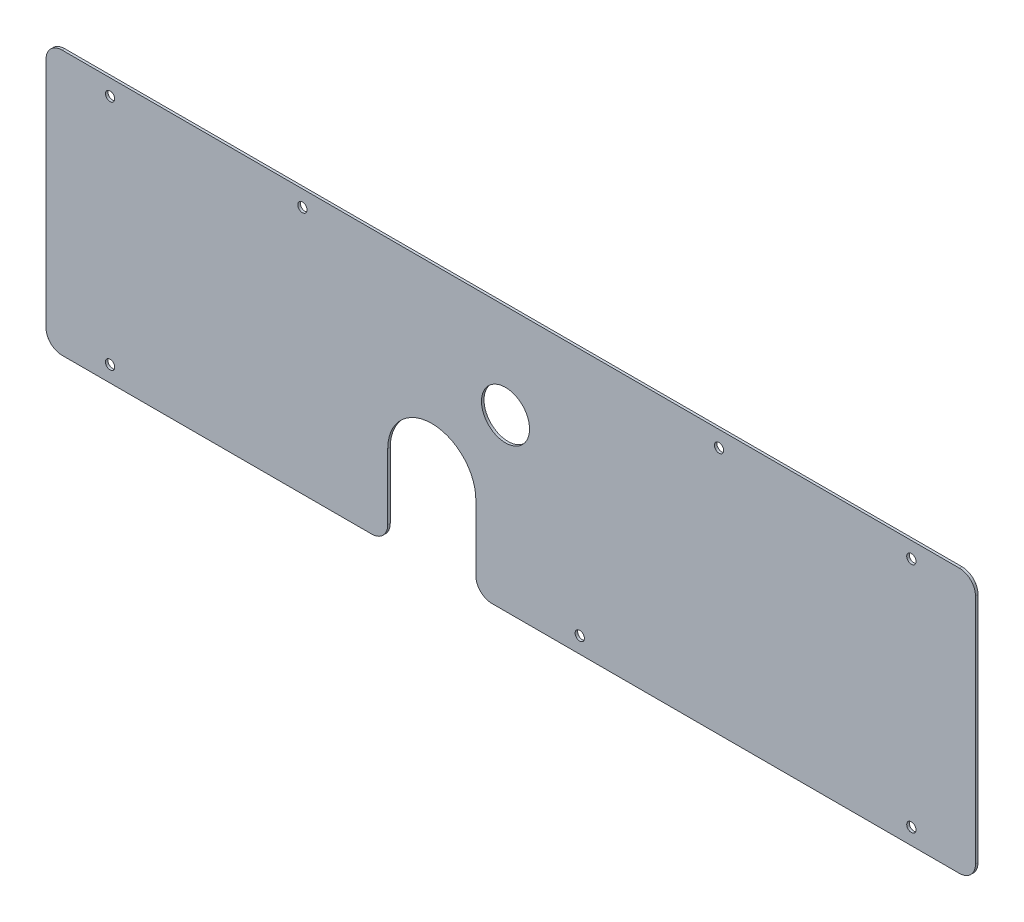
ISO-10303-21;
HEADER;
FILE_DESCRIPTION(('STEP AP214'),'2;1');
FILE_NAME('part.step','',(''),(''),'','','');
FILE_SCHEMA(('AUTOMOTIVE_DESIGN { 1 0 10303 214 1 1 1 1 }'));
ENDSEC;
DATA;
#1=APPLICATION_CONTEXT('core data for automotive mechanical design processes');
#2=APPLICATION_PROTOCOL_DEFINITION('international standard','automotive_design',2000,#1);
#3=PRODUCT_CONTEXT('',#1,'mechanical');
#4=PRODUCT('Part','Part','',(#3));
#5=PRODUCT_RELATED_PRODUCT_CATEGORY('part','',(#4));
#6=PRODUCT_DEFINITION_FORMATION('','',#4);
#7=PRODUCT_DEFINITION_CONTEXT('part definition',#1,'design');
#8=PRODUCT_DEFINITION('design','',#6,#7);
#9=PRODUCT_DEFINITION_SHAPE('','',#8);
#10=(LENGTH_UNIT() NAMED_UNIT(*) SI_UNIT(.MILLI.,.METRE.));
#11=(NAMED_UNIT(*) PLANE_ANGLE_UNIT() SI_UNIT($,.RADIAN.));
#12=(NAMED_UNIT(*) SI_UNIT($,.STERADIAN.) SOLID_ANGLE_UNIT());
#13=UNCERTAINTY_MEASURE_WITH_UNIT(LENGTH_MEASURE(1.E-05),#10,'distance_accuracy_value','');
#14=(GEOMETRIC_REPRESENTATION_CONTEXT(3) GLOBAL_UNCERTAINTY_ASSIGNED_CONTEXT((#13)) GLOBAL_UNIT_ASSIGNED_CONTEXT((#10,
#11,#12)) REPRESENTATION_CONTEXT('',''));
#15=CARTESIAN_POINT('',(0.,0.,0.));
#16=DIRECTION('',(0.,0.,1.));
#17=DIRECTION('',(1.,0.,0.));
#18=AXIS2_PLACEMENT_3D('',#15,#16,#17);
#19=CARTESIAN_POINT('',(-4.22130487143509,-10.7699955492583,1.5875));
#20=DIRECTION('',(0.,0.,1.));
#21=DIRECTION('',(1.,0.,0.));
#22=AXIS2_PLACEMENT_3D('',#19,#20,#21);
#23=PLANE('',#22);
#24=CARTESIAN_POINT('',(-204.957511761531,93.1698044507419,1.5875));
#25=DIRECTION('',(0.,0.,1.));
#26=DIRECTION('',(1.,0.,0.));
#27=AXIS2_PLACEMENT_3D('',#24,#25,#26);
#28=CIRCLE('',#27,2.89999999999999);
#29=CARTESIAN_POINT('',(-202.057511761531,93.1698044507419,1.5875));
#30=VERTEX_POINT('',#29);
#31=EDGE_CURVE('E326',#30,#30,#28,.T.);
#32=ORIENTED_EDGE('',*,*,#31,.F.);
#33=EDGE_LOOP('',(#32));
#34=FACE_BOUND('',#33,.T.);
#35=CARTESIAN_POINT('',(-204.957511761531,-51.8097955492581,1.5875));
#36=DIRECTION('',(0.,0.,1.));
#37=DIRECTION('',(1.,0.,0.));
#38=AXIS2_PLACEMENT_3D('',#35,#36,#37);
#39=CIRCLE('',#38,2.89999999999999);
#40=CARTESIAN_POINT('',(-202.057511761531,-51.8097955492581,1.5875));
#41=VERTEX_POINT('',#40);
#42=EDGE_CURVE('E320',#41,#41,#39,.T.);
#43=ORIENTED_EDGE('',*,*,#42,.F.);
#44=EDGE_LOOP('',(#43));
#45=FACE_BOUND('',#44,.T.);
#46=CARTESIAN_POINT('',(88.1217757354174,-51.8097955492581,1.5875));
#47=DIRECTION('',(0.,0.,1.));
#48=DIRECTION('',(1.,0.,0.));
#49=AXIS2_PLACEMENT_3D('',#46,#47,#48);
#50=CIRCLE('',#49,2.89999999999999);
#51=CARTESIAN_POINT('',(91.0217757354174,-51.8097955492581,1.5875));
#52=VERTEX_POINT('',#51);
#53=EDGE_CURVE('E314',#52,#52,#50,.T.);
#54=ORIENTED_EDGE('',*,*,#53,.F.);
#55=EDGE_LOOP('',(#54));
#56=FACE_BOUND('',#55,.T.);
#57=CARTESIAN_POINT('',(295.042488238469,-51.8097955492581,1.5875));
#58=DIRECTION('',(0.,0.,1.));
#59=DIRECTION('',(1.,0.,0.));
#60=AXIS2_PLACEMENT_3D('',#57,#58,#59);
#61=CIRCLE('',#60,2.90000000000001);
#62=CARTESIAN_POINT('',(297.942488238469,-51.8097955492581,1.5875));
#63=VERTEX_POINT('',#62);
#64=EDGE_CURVE('E308',#63,#63,#61,.T.);
#65=ORIENTED_EDGE('',*,*,#64,.F.);
#66=EDGE_LOOP('',(#65));
#67=FACE_BOUND('',#66,.T.);
#68=CARTESIAN_POINT('',(-84.9575117615307,93.1698044507419,1.5875));
#69=DIRECTION('',(0.,0.,1.));
#70=DIRECTION('',(1.,0.,0.));
#71=AXIS2_PLACEMENT_3D('',#68,#69,#70);
#72=CIRCLE('',#71,2.89999999999999);
#73=CARTESIAN_POINT('',(-82.0575117615307,93.1698044507419,1.5875));
#74=VERTEX_POINT('',#73);
#75=EDGE_CURVE('E302',#74,#74,#72,.T.);
#76=ORIENTED_EDGE('',*,*,#75,.F.);
#77=EDGE_LOOP('',(#76));
#78=FACE_BOUND('',#77,.T.);
#79=CARTESIAN_POINT('',(175.042488238469,93.1698044507419,1.5875));
#80=DIRECTION('',(0.,0.,1.));
#81=DIRECTION('',(1.,0.,0.));
#82=AXIS2_PLACEMENT_3D('',#79,#80,#81);
#83=CIRCLE('',#82,2.89999999999999);
#84=CARTESIAN_POINT('',(177.942488238469,93.1698044507419,1.5875));
#85=VERTEX_POINT('',#84);
#86=EDGE_CURVE('E296',#85,#85,#83,.T.);
#87=ORIENTED_EDGE('',*,*,#86,.F.);
#88=EDGE_LOOP('',(#87));
#89=FACE_BOUND('',#88,.T.);
#90=CARTESIAN_POINT('',(295.042488238469,93.1698044507419,1.5875));
#91=DIRECTION('',(0.,0.,1.));
#92=DIRECTION('',(1.,0.,0.));
#93=AXIS2_PLACEMENT_3D('',#90,#91,#92);
#94=CIRCLE('',#93,2.90000000000001);
#95=CARTESIAN_POINT('',(297.942488238469,93.1698044507419,1.5875));
#96=VERTEX_POINT('',#95);
#97=EDGE_CURVE('E290',#96,#96,#94,.T.);
#98=ORIENTED_EDGE('',*,*,#97,.F.);
#99=EDGE_LOOP('',(#98));
#100=FACE_BOUND('',#99,.T.);
#101=DIRECTION('',(0.,-1.,0.));
#102=VECTOR('',#101,1.);
#103=CARTESIAN_POINT('',(23.2786951285649,-10.7699955492583,1.5875));
#104=LINE('',#103,#102);
#105=CARTESIAN_POINT('',(23.2786951285649,-10.7699955492583,1.5875));
#106=VERTEX_POINT('',#105);
#107=CARTESIAN_POINT('',(23.2786951285649,-51.8097955492581,1.5875));
#108=VERTEX_POINT('',#107);
#109=EDGE_CURVE('E165',#106,#108,#104,.T.);
#110=ORIENTED_EDGE('',*,*,#109,.T.);
#111=CARTESIAN_POINT('',(33.2786951285649,-51.8097955492581,1.5875));
#112=DIRECTION('',(0.,0.,1.));
#113=DIRECTION('',(1.,0.,0.));
#114=AXIS2_PLACEMENT_3D('',#111,#112,#113);
#115=CIRCLE('',#114,10.);
#116=CARTESIAN_POINT('',(33.2786951285649,-61.8097955492581,1.5875));
#117=VERTEX_POINT('',#116);
#118=EDGE_CURVE('E226',#108,#117,#115,.T.);
#119=ORIENTED_EDGE('',*,*,#118,.T.);
#120=DIRECTION('',(1.,0.,0.));
#121=VECTOR('',#120,1.);
#122=CARTESIAN_POINT('',(23.2786951285649,-61.8097955492581,1.5875));
#123=LINE('',#122,#121);
#124=CARTESIAN_POINT('',(325.042488238469,-61.809795549258,1.5875));
#125=VERTEX_POINT('',#124);
#126=EDGE_CURVE('E167',#117,#125,#123,.T.);
#127=ORIENTED_EDGE('',*,*,#126,.T.);
#128=CARTESIAN_POINT('',(325.042488238469,-51.809795549258,1.5875));
#129=DIRECTION('',(0.,0.,1.));
#130=DIRECTION('',(1.,0.,0.));
#131=AXIS2_PLACEMENT_3D('',#128,#129,#130);
#132=CIRCLE('',#131,10.);
#133=CARTESIAN_POINT('',(335.042488238469,-51.809795549258,1.5875));
#134=VERTEX_POINT('',#133);
#135=EDGE_CURVE('E218',#125,#134,#132,.T.);
#136=ORIENTED_EDGE('',*,*,#135,.T.);
#137=DIRECTION('',(0.,1.,0.));
#138=VECTOR('',#137,1.);
#139=CARTESIAN_POINT('',(335.042488238469,103.169804450742,1.5875));
#140=LINE('',#139,#138);
#141=CARTESIAN_POINT('',(335.042488238469,93.1698044507419,1.5875));
#142=VERTEX_POINT('',#141);
#143=EDGE_CURVE('E173',#134,#142,#140,.T.);
#144=ORIENTED_EDGE('',*,*,#143,.T.);
#145=CARTESIAN_POINT('',(325.042488238469,93.1698044507419,1.5875));
#146=DIRECTION('',(0.,0.,1.));
#147=DIRECTION('',(1.,0.,0.));
#148=AXIS2_PLACEMENT_3D('',#145,#146,#147);
#149=CIRCLE('',#148,10.);
#150=CARTESIAN_POINT('',(325.042488238469,103.169804450742,1.5875));
#151=VERTEX_POINT('',#150);
#152=EDGE_CURVE('E59',#142,#151,#149,.T.);
#153=ORIENTED_EDGE('',*,*,#152,.T.);
#154=DIRECTION('',(-1.,0.,0.));
#155=VECTOR('',#154,1.);
#156=CARTESIAN_POINT('',(-244.957511761531,103.169804450742,1.5875));
#157=LINE('',#156,#155);
#158=CARTESIAN_POINT('',(-234.957511761531,103.169804450742,1.5875));
#159=VERTEX_POINT('',#158);
#160=EDGE_CURVE('E175',#151,#159,#157,.T.);
#161=ORIENTED_EDGE('',*,*,#160,.T.);
#162=CARTESIAN_POINT('',(-234.957511761531,93.1698044507419,1.5875));
#163=DIRECTION('',(0.,0.,1.));
#164=DIRECTION('',(1.,0.,0.));
#165=AXIS2_PLACEMENT_3D('',#162,#163,#164);
#166=CIRCLE('',#165,10.);
#167=CARTESIAN_POINT('',(-244.957511761531,93.1698044507419,1.5875));
#168=VERTEX_POINT('',#167);
#169=EDGE_CURVE('E223',#159,#168,#166,.T.);
#170=ORIENTED_EDGE('',*,*,#169,.T.);
#171=DIRECTION('',(0.,-1.,0.));
#172=VECTOR('',#171,1.);
#173=CARTESIAN_POINT('',(-244.957511761531,103.169804450742,1.5875));
#174=LINE('',#173,#172);
#175=CARTESIAN_POINT('',(-244.957511761531,-51.8097955492581,1.5875));
#176=VERTEX_POINT('',#175);
#177=EDGE_CURVE('E198',#168,#176,#174,.T.);
#178=ORIENTED_EDGE('',*,*,#177,.T.);
#179=CARTESIAN_POINT('',(-234.957511761531,-51.8097955492581,1.5875));
#180=DIRECTION('',(0.,0.,1.));
#181=DIRECTION('',(1.,0.,0.));
#182=AXIS2_PLACEMENT_3D('',#179,#180,#181);
#183=CIRCLE('',#182,10.);
#184=CARTESIAN_POINT('',(-234.957511761531,-61.8097955492581,1.5875));
#185=VERTEX_POINT('',#184);
#186=EDGE_CURVE('E221',#176,#185,#183,.T.);
#187=ORIENTED_EDGE('',*,*,#186,.T.);
#188=DIRECTION('',(1.,0.,0.));
#189=VECTOR('',#188,1.);
#190=CARTESIAN_POINT('',(-244.957511761531,-61.8097955492581,1.5875));
#191=LINE('',#190,#189);
#192=CARTESIAN_POINT('',(-41.7213048714351,-61.8097955492581,1.5875));
#193=VERTEX_POINT('',#192);
#194=EDGE_CURVE('E150',#185,#193,#191,.T.);
#195=ORIENTED_EDGE('',*,*,#194,.T.);
#196=CARTESIAN_POINT('',(-41.7213048714351,-51.8097955492581,1.5875));
#197=DIRECTION('',(0.,0.,1.));
#198=DIRECTION('',(1.,0.,0.));
#199=AXIS2_PLACEMENT_3D('',#196,#197,#198);
#200=CIRCLE('',#199,10.);
#201=CARTESIAN_POINT('',(-31.7213048714351,-51.8097955492581,1.5875));
#202=VERTEX_POINT('',#201);
#203=EDGE_CURVE('E146',#193,#202,#200,.T.);
#204=ORIENTED_EDGE('',*,*,#203,.T.);
#205=DIRECTION('',(0.,1.,0.));
#206=VECTOR('',#205,1.);
#207=CARTESIAN_POINT('',(-31.7213048714351,-10.7699955492583,1.5875));
#208=LINE('',#207,#206);
#209=CARTESIAN_POINT('',(-31.7213048714351,-10.7699955492583,1.5875));
#210=VERTEX_POINT('',#209);
#211=EDGE_CURVE('E137',#202,#210,#208,.T.);
#212=ORIENTED_EDGE('',*,*,#211,.T.);
#213=CARTESIAN_POINT('',(-4.22130487143509,-10.7699955492583,1.5875));
#214=DIRECTION('',(0.,0.,-1.));
#215=DIRECTION('',(1.,0.,0.));
#216=AXIS2_PLACEMENT_3D('',#213,#214,#215);
#217=CIRCLE('',#216,27.5);
#218=EDGE_CURVE('E142',#210,#106,#217,.T.);
#219=ORIENTED_EDGE('',*,*,#218,.T.);
#220=EDGE_LOOP('',(#110,#119,#127,#136,#144,#153,#161,#170,#178,#187,#195,#204,#212,#219));
#221=FACE_BOUND('',#220,.T.);
#222=CARTESIAN_POINT('',(41.7786951285649,44.2300044507417,1.5875));
#223=DIRECTION('',(0.,0.,1.));
#224=DIRECTION('',(1.,0.,0.));
#225=AXIS2_PLACEMENT_3D('',#222,#223,#224);
#226=CIRCLE('',#225,15.);
#227=CARTESIAN_POINT('',(56.7786951285649,44.2300044507417,1.5875));
#228=VERTEX_POINT('',#227);
#229=EDGE_CURVE('E181',#228,#228,#226,.T.);
#230=ORIENTED_EDGE('',*,*,#229,.F.);
#231=EDGE_LOOP('',(#230));
#232=FACE_BOUND('',#231,.T.);
#233=ADVANCED_FACE('F37',(#34,#45,#56,#67,#78,#89,#100,#221,#232),#23,.T.);
#234=CARTESIAN_POINT('',(-4.22130487143509,-10.7699955492583,0.));
#235=DIRECTION('',(0.,0.,1.));
#236=DIRECTION('',(1.,0.,0.));
#237=AXIS2_PLACEMENT_3D('',#234,#235,#236);
#238=PLANE('',#237);
#239=CARTESIAN_POINT('',(-204.957511761531,93.1698044507419,0.));
#240=DIRECTION('',(0.,0.,1.));
#241=DIRECTION('',(1.,0.,0.));
#242=AXIS2_PLACEMENT_3D('',#239,#240,#241);
#243=CIRCLE('',#242,2.89999999999999);
#244=CARTESIAN_POINT('',(-202.057511761531,93.1698044507419,0.));
#245=VERTEX_POINT('',#244);
#246=EDGE_CURVE('E323',#245,#245,#243,.T.);
#247=ORIENTED_EDGE('',*,*,#246,.T.);
#248=EDGE_LOOP('',(#247));
#249=FACE_BOUND('',#248,.T.);
#250=CARTESIAN_POINT('',(-204.957511761531,-51.8097955492581,0.));
#251=DIRECTION('',(0.,0.,1.));
#252=DIRECTION('',(1.,0.,0.));
#253=AXIS2_PLACEMENT_3D('',#250,#251,#252);
#254=CIRCLE('',#253,2.89999999999999);
#255=CARTESIAN_POINT('',(-202.057511761531,-51.8097955492581,0.));
#256=VERTEX_POINT('',#255);
#257=EDGE_CURVE('E317',#256,#256,#254,.T.);
#258=ORIENTED_EDGE('',*,*,#257,.T.);
#259=EDGE_LOOP('',(#258));
#260=FACE_BOUND('',#259,.T.);
#261=CARTESIAN_POINT('',(88.1217757354174,-51.8097955492581,0.));
#262=DIRECTION('',(0.,0.,1.));
#263=DIRECTION('',(1.,0.,0.));
#264=AXIS2_PLACEMENT_3D('',#261,#262,#263);
#265=CIRCLE('',#264,2.9);
#266=CARTESIAN_POINT('',(91.0217757354174,-51.8097955492581,0.));
#267=VERTEX_POINT('',#266);
#268=EDGE_CURVE('E311',#267,#267,#265,.T.);
#269=ORIENTED_EDGE('',*,*,#268,.T.);
#270=EDGE_LOOP('',(#269));
#271=FACE_BOUND('',#270,.T.);
#272=CARTESIAN_POINT('',(295.042488238469,-51.8097955492581,0.));
#273=DIRECTION('',(0.,0.,1.));
#274=DIRECTION('',(1.,0.,0.));
#275=AXIS2_PLACEMENT_3D('',#272,#273,#274);
#276=CIRCLE('',#275,2.90000000000001);
#277=CARTESIAN_POINT('',(297.942488238469,-51.8097955492581,0.));
#278=VERTEX_POINT('',#277);
#279=EDGE_CURVE('E305',#278,#278,#276,.T.);
#280=ORIENTED_EDGE('',*,*,#279,.T.);
#281=EDGE_LOOP('',(#280));
#282=FACE_BOUND('',#281,.T.);
#283=CARTESIAN_POINT('',(-84.9575117615307,93.1698044507419,0.));
#284=DIRECTION('',(0.,0.,1.));
#285=DIRECTION('',(1.,0.,0.));
#286=AXIS2_PLACEMENT_3D('',#283,#284,#285);
#287=CIRCLE('',#286,2.9);
#288=CARTESIAN_POINT('',(-82.0575117615307,93.1698044507419,0.));
#289=VERTEX_POINT('',#288);
#290=EDGE_CURVE('E299',#289,#289,#287,.T.);
#291=ORIENTED_EDGE('',*,*,#290,.T.);
#292=EDGE_LOOP('',(#291));
#293=FACE_BOUND('',#292,.T.);
#294=CARTESIAN_POINT('',(175.042488238469,93.1698044507419,0.));
#295=DIRECTION('',(0.,0.,1.));
#296=DIRECTION('',(1.,0.,0.));
#297=AXIS2_PLACEMENT_3D('',#294,#295,#296);
#298=CIRCLE('',#297,2.89999999999999);
#299=CARTESIAN_POINT('',(177.942488238469,93.1698044507419,0.));
#300=VERTEX_POINT('',#299);
#301=EDGE_CURVE('E293',#300,#300,#298,.T.);
#302=ORIENTED_EDGE('',*,*,#301,.T.);
#303=EDGE_LOOP('',(#302));
#304=FACE_BOUND('',#303,.T.);
#305=CARTESIAN_POINT('',(295.042488238469,93.1698044507419,0.));
#306=DIRECTION('',(0.,0.,1.));
#307=DIRECTION('',(1.,0.,0.));
#308=AXIS2_PLACEMENT_3D('',#305,#306,#307);
#309=CIRCLE('',#308,2.90000000000001);
#310=CARTESIAN_POINT('',(297.942488238469,93.1698044507419,0.));
#311=VERTEX_POINT('',#310);
#312=EDGE_CURVE('E285',#311,#311,#309,.T.);
#313=ORIENTED_EDGE('',*,*,#312,.T.);
#314=EDGE_LOOP('',(#313));
#315=FACE_BOUND('',#314,.T.);
#316=DIRECTION('',(1.,0.,0.));
#317=VECTOR('',#316,1.);
#318=CARTESIAN_POINT('',(23.2786951285649,-61.8097955492581,0.));
#319=LINE('',#318,#317);
#320=CARTESIAN_POINT('',(33.2786951285649,-61.8097955492581,0.));
#321=VERTEX_POINT('',#320);
#322=CARTESIAN_POINT('',(325.042488238469,-61.809795549258,0.));
#323=VERTEX_POINT('',#322);
#324=EDGE_CURVE('E190',#321,#323,#319,.T.);
#325=ORIENTED_EDGE('',*,*,#324,.F.);
#326=CARTESIAN_POINT('',(33.2786951285649,-51.8097955492581,0.));
#327=DIRECTION('',(0.,0.,1.));
#328=DIRECTION('',(1.,0.,0.));
#329=AXIS2_PLACEMENT_3D('',#326,#327,#328);
#330=CIRCLE('',#329,10.);
#331=CARTESIAN_POINT('',(23.2786951285649,-51.8097955492581,0.));
#332=VERTEX_POINT('',#331);
#333=EDGE_CURVE('E214',#321,#332,#330,.F.);
#334=ORIENTED_EDGE('',*,*,#333,.T.);
#335=DIRECTION('',(0.,-1.,0.));
#336=VECTOR('',#335,1.);
#337=CARTESIAN_POINT('',(23.2786951285649,-10.7699955492583,0.));
#338=LINE('',#337,#336);
#339=CARTESIAN_POINT('',(23.2786951285649,-10.7699955492583,0.));
#340=VERTEX_POINT('',#339);
#341=EDGE_CURVE('E187',#340,#332,#338,.T.);
#342=ORIENTED_EDGE('',*,*,#341,.F.);
#343=CARTESIAN_POINT('',(-4.22130487143509,-10.7699955492583,0.));
#344=DIRECTION('',(0.,0.,-1.));
#345=DIRECTION('',(1.,0.,0.));
#346=AXIS2_PLACEMENT_3D('',#343,#344,#345);
#347=CIRCLE('',#346,27.5);
#348=CARTESIAN_POINT('',(-31.7213048714351,-10.7699955492583,0.));
#349=VERTEX_POINT('',#348);
#350=EDGE_CURVE('E185',#349,#340,#347,.T.);
#351=ORIENTED_EDGE('',*,*,#350,.F.);
#352=DIRECTION('',(0.,1.,0.));
#353=VECTOR('',#352,1.);
#354=CARTESIAN_POINT('',(-31.7213048714351,-10.7699955492583,0.));
#355=LINE('',#354,#353);
#356=CARTESIAN_POINT('',(-31.7213048714351,-51.8097955492581,0.));
#357=VERTEX_POINT('',#356);
#358=EDGE_CURVE('E156',#357,#349,#355,.T.);
#359=ORIENTED_EDGE('',*,*,#358,.F.);
#360=CARTESIAN_POINT('',(-41.7213048714351,-51.8097955492581,0.));
#361=DIRECTION('',(0.,0.,1.));
#362=DIRECTION('',(1.,0.,0.));
#363=AXIS2_PLACEMENT_3D('',#360,#361,#362);
#364=CIRCLE('',#363,10.);
#365=CARTESIAN_POINT('',(-41.7213048714351,-61.8097955492581,0.));
#366=VERTEX_POINT('',#365);
#367=EDGE_CURVE('E212',#357,#366,#364,.F.);
#368=ORIENTED_EDGE('',*,*,#367,.T.);
#369=DIRECTION('',(1.,0.,0.));
#370=VECTOR('',#369,1.);
#371=CARTESIAN_POINT('',(-244.957511761531,-61.8097955492581,0.));
#372=LINE('',#371,#370);
#373=CARTESIAN_POINT('',(-234.957511761531,-61.8097955492581,0.));
#374=VERTEX_POINT('',#373);
#375=EDGE_CURVE('E180',#374,#366,#372,.T.);
#376=ORIENTED_EDGE('',*,*,#375,.F.);
#377=CARTESIAN_POINT('',(-234.957511761531,-51.8097955492581,0.));
#378=DIRECTION('',(0.,0.,1.));
#379=DIRECTION('',(1.,0.,0.));
#380=AXIS2_PLACEMENT_3D('',#377,#378,#379);
#381=CIRCLE('',#380,10.);
#382=CARTESIAN_POINT('',(-244.957511761531,-51.8097955492581,0.));
#383=VERTEX_POINT('',#382);
#384=EDGE_CURVE('E208',#374,#383,#381,.F.);
#385=ORIENTED_EDGE('',*,*,#384,.T.);
#386=DIRECTION('',(0.,-1.,0.));
#387=VECTOR('',#386,1.);
#388=CARTESIAN_POINT('',(-244.957511761531,103.169804450742,0.));
#389=LINE('',#388,#387);
#390=CARTESIAN_POINT('',(-244.957511761531,93.1698044507419,0.));
#391=VERTEX_POINT('',#390);
#392=EDGE_CURVE('E177',#391,#383,#389,.T.);
#393=ORIENTED_EDGE('',*,*,#392,.F.);
#394=CARTESIAN_POINT('',(-234.957511761531,93.1698044507419,0.));
#395=DIRECTION('',(0.,0.,1.));
#396=DIRECTION('',(1.,0.,0.));
#397=AXIS2_PLACEMENT_3D('',#394,#395,#396);
#398=CIRCLE('',#397,10.);
#399=CARTESIAN_POINT('',(-234.957511761531,103.169804450742,0.));
#400=VERTEX_POINT('',#399);
#401=EDGE_CURVE('E210',#391,#400,#398,.F.);
#402=ORIENTED_EDGE('',*,*,#401,.T.);
#403=DIRECTION('',(-1.,0.,0.));
#404=VECTOR('',#403,1.);
#405=CARTESIAN_POINT('',(-244.957511761531,103.169804450742,0.));
#406=LINE('',#405,#404);
#407=CARTESIAN_POINT('',(325.042488238469,103.169804450742,0.));
#408=VERTEX_POINT('',#407);
#409=EDGE_CURVE('E196',#408,#400,#406,.T.);
#410=ORIENTED_EDGE('',*,*,#409,.F.);
#411=CARTESIAN_POINT('',(325.042488238469,93.1698044507419,0.));
#412=DIRECTION('',(0.,0.,1.));
#413=DIRECTION('',(1.,0.,0.));
#414=AXIS2_PLACEMENT_3D('',#411,#412,#413);
#415=CIRCLE('',#414,10.);
#416=CARTESIAN_POINT('',(335.042488238469,93.1698044507419,0.));
#417=VERTEX_POINT('',#416);
#418=EDGE_CURVE('E206',#408,#417,#415,.F.);
#419=ORIENTED_EDGE('',*,*,#418,.T.);
#420=DIRECTION('',(0.,1.,0.));
#421=VECTOR('',#420,1.);
#422=CARTESIAN_POINT('',(335.042488238469,103.169804450742,0.));
#423=LINE('',#422,#421);
#424=CARTESIAN_POINT('',(335.042488238469,-51.809795549258,0.));
#425=VERTEX_POINT('',#424);
#426=EDGE_CURVE('E193',#425,#417,#423,.T.);
#427=ORIENTED_EDGE('',*,*,#426,.F.);
#428=CARTESIAN_POINT('',(325.042488238469,-51.809795549258,0.));
#429=DIRECTION('',(0.,0.,1.));
#430=DIRECTION('',(1.,0.,0.));
#431=AXIS2_PLACEMENT_3D('',#428,#429,#430);
#432=CIRCLE('',#431,10.);
#433=EDGE_CURVE('E204',#425,#323,#432,.F.);
#434=ORIENTED_EDGE('',*,*,#433,.T.);
#435=EDGE_LOOP('',(#325,#334,#342,#351,#359,#368,#376,#385,#393,#402,#410,#419,#427,#434));
#436=FACE_BOUND('',#435,.T.);
#437=CARTESIAN_POINT('',(41.7786951285649,44.2300044507417,0.));
#438=DIRECTION('',(0.,0.,1.));
#439=DIRECTION('',(1.,0.,0.));
#440=AXIS2_PLACEMENT_3D('',#437,#438,#439);
#441=CIRCLE('',#440,15.);
#442=CARTESIAN_POINT('',(56.7786951285649,44.2300044507417,0.));
#443=VERTEX_POINT('',#442);
#444=EDGE_CURVE('E282',#443,#443,#441,.T.);
#445=ORIENTED_EDGE('',*,*,#444,.T.);
#446=EDGE_LOOP('',(#445));
#447=FACE_BOUND('',#446,.T.);
#448=ADVANCED_FACE('F254',(#249,#260,#271,#282,#293,#304,#315,#436,#447),#238,.F.);
#449=CARTESIAN_POINT('',(-244.957511761531,103.169804450742,1.5875));
#450=DIRECTION('',(1.,0.,0.));
#451=DIRECTION('',(0.,0.,-1.));
#452=AXIS2_PLACEMENT_3D('',#449,#450,#451);
#453=PLANE('',#452);
#454=ORIENTED_EDGE('',*,*,#177,.F.);
#455=DIRECTION('',(0.,0.,-1.));
#456=VECTOR('',#455,1.);
#457=CARTESIAN_POINT('',(-244.957511761531,93.1698044507419,1.5875));
#458=LINE('',#457,#456);
#459=EDGE_CURVE('E237',#168,#391,#458,.T.);
#460=ORIENTED_EDGE('',*,*,#459,.T.);
#461=ORIENTED_EDGE('',*,*,#392,.T.);
#462=DIRECTION('',(0.,0.,-1.));
#463=VECTOR('',#462,1.);
#464=CARTESIAN_POINT('',(-244.957511761531,-51.8097955492581,1.5875));
#465=LINE('',#464,#463);
#466=EDGE_CURVE('E235',#383,#176,#465,.F.);
#467=ORIENTED_EDGE('',*,*,#466,.T.);
#468=EDGE_LOOP('',(#454,#460,#461,#467));
#469=FACE_BOUND('',#468,.T.);
#470=ADVANCED_FACE('F269',(#469),#453,.F.);
#471=CARTESIAN_POINT('',(-244.957511761531,-61.8097955492581,1.5875));
#472=DIRECTION('',(0.,1.,0.));
#473=DIRECTION('',(-1.,0.,0.));
#474=AXIS2_PLACEMENT_3D('',#471,#472,#473);
#475=PLANE('',#474);
#476=ORIENTED_EDGE('',*,*,#375,.T.);
#477=DIRECTION('',(0.,0.,-1.));
#478=VECTOR('',#477,1.);
#479=CARTESIAN_POINT('',(-41.7213048714351,-61.8097955492581,1.5875));
#480=LINE('',#479,#478);
#481=EDGE_CURVE('E233',#366,#193,#480,.F.);
#482=ORIENTED_EDGE('',*,*,#481,.T.);
#483=ORIENTED_EDGE('',*,*,#194,.F.);
#484=DIRECTION('',(0.,0.,-1.));
#485=VECTOR('',#484,1.);
#486=CARTESIAN_POINT('',(-234.957511761531,-61.8097955492581,1.5875));
#487=LINE('',#486,#485);
#488=EDGE_CURVE('E230',#185,#374,#487,.T.);
#489=ORIENTED_EDGE('',*,*,#488,.T.);
#490=EDGE_LOOP('',(#476,#482,#483,#489));
#491=FACE_BOUND('',#490,.T.);
#492=ADVANCED_FACE('F278',(#491),#475,.F.);
#493=CARTESIAN_POINT('',(-31.7213048714351,-10.7699955492583,1.5875));
#494=DIRECTION('',(-1.,0.,0.));
#495=DIRECTION('',(0.,-1.,0.));
#496=AXIS2_PLACEMENT_3D('',#493,#494,#495);
#497=PLANE('',#496);
#498=ORIENTED_EDGE('',*,*,#211,.F.);
#499=DIRECTION('',(0.,0.,-1.));
#500=VECTOR('',#499,1.);
#501=CARTESIAN_POINT('',(-31.7213048714351,-51.8097955492581,1.5875));
#502=LINE('',#501,#500);
#503=EDGE_CURVE('E228',#202,#357,#502,.T.);
#504=ORIENTED_EDGE('',*,*,#503,.T.);
#505=ORIENTED_EDGE('',*,*,#358,.T.);
#506=DIRECTION('',(0.,0.,-1.));
#507=VECTOR('',#506,1.);
#508=CARTESIAN_POINT('',(-31.7213048714351,-10.7699955492583,1.5875));
#509=LINE('',#508,#507);
#510=EDGE_CURVE('E153',#210,#349,#509,.T.);
#511=ORIENTED_EDGE('',*,*,#510,.F.);
#512=EDGE_LOOP('',(#498,#504,#505,#511));
#513=FACE_BOUND('',#512,.T.);
#514=ADVANCED_FACE('F154',(#513),#497,.F.);
#515=CARTESIAN_POINT('',(-4.22130487143509,-10.7699955492583,1.5875));
#516=DIRECTION('',(0.,0.,-1.));
#517=DIRECTION('',(-1.,0.,0.));
#518=AXIS2_PLACEMENT_3D('',#515,#516,#517);
#519=CYLINDRICAL_SURFACE('',#518,27.5);
#520=ORIENTED_EDGE('',*,*,#350,.T.);
#521=DIRECTION('',(0.,0.,-1.));
#522=VECTOR('',#521,1.);
#523=CARTESIAN_POINT('',(23.2786951285649,-10.7699955492583,1.5875));
#524=LINE('',#523,#522);
#525=EDGE_CURVE('E160',#106,#340,#524,.T.);
#526=ORIENTED_EDGE('',*,*,#525,.F.);
#527=ORIENTED_EDGE('',*,*,#218,.F.);
#528=ORIENTED_EDGE('',*,*,#510,.T.);
#529=EDGE_LOOP('',(#520,#526,#527,#528));
#530=FACE_BOUND('',#529,.T.);
#531=ADVANCED_FACE('F162',(#530),#519,.F.);
#532=CARTESIAN_POINT('',(23.2786951285649,-10.7699955492583,1.5875));
#533=DIRECTION('',(1.,0.,0.));
#534=DIRECTION('',(0.,1.,0.));
#535=AXIS2_PLACEMENT_3D('',#532,#533,#534);
#536=PLANE('',#535);
#537=ORIENTED_EDGE('',*,*,#341,.T.);
#538=DIRECTION('',(0.,0.,-1.));
#539=VECTOR('',#538,1.);
#540=CARTESIAN_POINT('',(23.2786951285649,-51.8097955492581,1.5875));
#541=LINE('',#540,#539);
#542=EDGE_CURVE('E216',#332,#108,#541,.F.);
#543=ORIENTED_EDGE('',*,*,#542,.T.);
#544=ORIENTED_EDGE('',*,*,#109,.F.);
#545=ORIENTED_EDGE('',*,*,#525,.T.);
#546=EDGE_LOOP('',(#537,#543,#544,#545));
#547=FACE_BOUND('',#546,.T.);
#548=ADVANCED_FACE('F375',(#547),#536,.F.);
#549=CARTESIAN_POINT('',(23.2786951285649,-61.8097955492581,1.5875));
#550=DIRECTION('',(0.,1.,0.));
#551=DIRECTION('',(-1.,0.,0.));
#552=AXIS2_PLACEMENT_3D('',#549,#550,#551);
#553=PLANE('',#552);
#554=ORIENTED_EDGE('',*,*,#126,.F.);
#555=DIRECTION('',(0.,0.,-1.));
#556=VECTOR('',#555,1.);
#557=CARTESIAN_POINT('',(33.2786951285649,-61.8097955492581,1.5875));
#558=LINE('',#557,#556);
#559=EDGE_CURVE('E201',#117,#321,#558,.T.);
#560=ORIENTED_EDGE('',*,*,#559,.T.);
#561=ORIENTED_EDGE('',*,*,#324,.T.);
#562=DIRECTION('',(0.,0.,-1.));
#563=VECTOR('',#562,1.);
#564=CARTESIAN_POINT('',(325.042488238469,-61.809795549258,1.5875));
#565=LINE('',#564,#563);
#566=EDGE_CURVE('E159',#323,#125,#565,.F.);
#567=ORIENTED_EDGE('',*,*,#566,.T.);
#568=EDGE_LOOP('',(#554,#560,#561,#567));
#569=FACE_BOUND('',#568,.T.);
#570=ADVANCED_FACE('F372',(#569),#553,.F.);
#571=CARTESIAN_POINT('',(335.042488238469,103.169804450742,1.5875));
#572=DIRECTION('',(-1.,0.,0.));
#573=DIRECTION('',(0.,0.,1.));
#574=AXIS2_PLACEMENT_3D('',#571,#572,#573);
#575=PLANE('',#574);
#576=ORIENTED_EDGE('',*,*,#426,.T.);
#577=DIRECTION('',(0.,0.,-1.));
#578=VECTOR('',#577,1.);
#579=CARTESIAN_POINT('',(335.042488238469,93.1698044507419,1.5875));
#580=LINE('',#579,#578);
#581=EDGE_CURVE('E11',#417,#142,#580,.F.);
#582=ORIENTED_EDGE('',*,*,#581,.T.);
#583=ORIENTED_EDGE('',*,*,#143,.F.);
#584=DIRECTION('',(0.,0.,-1.));
#585=VECTOR('',#584,1.);
#586=CARTESIAN_POINT('',(335.042488238469,-51.809795549258,1.5875));
#587=LINE('',#586,#585);
#588=EDGE_CURVE('E45',#134,#425,#587,.T.);
#589=ORIENTED_EDGE('',*,*,#588,.T.);
#590=EDGE_LOOP('',(#576,#582,#583,#589));
#591=FACE_BOUND('',#590,.T.);
#592=ADVANCED_FACE('F248',(#591),#575,.F.);
#593=CARTESIAN_POINT('',(-244.957511761531,103.169804450742,1.5875));
#594=DIRECTION('',(0.,-1.,0.));
#595=DIRECTION('',(0.,0.,-1.));
#596=AXIS2_PLACEMENT_3D('',#593,#594,#595);
#597=PLANE('',#596);
#598=ORIENTED_EDGE('',*,*,#409,.T.);
#599=DIRECTION('',(0.,0.,-1.));
#600=VECTOR('',#599,1.);
#601=CARTESIAN_POINT('',(-234.957511761531,103.169804450742,1.5875));
#602=LINE('',#601,#600);
#603=EDGE_CURVE('E52',#400,#159,#602,.F.);
#604=ORIENTED_EDGE('',*,*,#603,.T.);
#605=ORIENTED_EDGE('',*,*,#160,.F.);
#606=DIRECTION('',(0.,0.,-1.));
#607=VECTOR('',#606,1.);
#608=CARTESIAN_POINT('',(325.042488238469,103.169804450742,1.5875));
#609=LINE('',#608,#607);
#610=EDGE_CURVE('E240',#151,#408,#609,.T.);
#611=ORIENTED_EDGE('',*,*,#610,.T.);
#612=EDGE_LOOP('',(#598,#604,#605,#611));
#613=FACE_BOUND('',#612,.T.);
#614=ADVANCED_FACE('F260',(#613),#597,.F.);
#615=CARTESIAN_POINT('',(41.7786951285649,44.2300044507417,1.5875));
#616=DIRECTION('',(0.,0.,-1.));
#617=DIRECTION('',(-1.,0.,0.));
#618=AXIS2_PLACEMENT_3D('',#615,#616,#617);
#619=CYLINDRICAL_SURFACE('',#618,15.);
#620=ORIENTED_EDGE('',*,*,#229,.T.);
#621=EDGE_LOOP('',(#620));
#622=FACE_BOUND('',#621,.T.);
#623=ORIENTED_EDGE('',*,*,#444,.F.);
#624=EDGE_LOOP('',(#623));
#625=FACE_BOUND('',#624,.T.);
#626=ADVANCED_FACE('F350',(#622,#625),#619,.F.);
#627=CARTESIAN_POINT('',(295.042488238469,93.1698044507419,1.5875));
#628=DIRECTION('',(0.,0.,1.));
#629=DIRECTION('',(1.,0.,0.));
#630=AXIS2_PLACEMENT_3D('',#627,#628,#629);
#631=CYLINDRICAL_SURFACE('',#630,2.90000000000001);
#632=ORIENTED_EDGE('',*,*,#312,.F.);
#633=EDGE_LOOP('',(#632));
#634=FACE_BOUND('',#633,.T.);
#635=ORIENTED_EDGE('',*,*,#97,.T.);
#636=EDGE_LOOP('',(#635));
#637=FACE_BOUND('',#636,.T.);
#638=ADVANCED_FACE('F347',(#634,#637),#631,.F.);
#639=CARTESIAN_POINT('',(175.042488238469,93.1698044507419,1.5875));
#640=DIRECTION('',(0.,0.,1.));
#641=DIRECTION('',(1.,0.,0.));
#642=AXIS2_PLACEMENT_3D('',#639,#640,#641);
#643=CYLINDRICAL_SURFACE('',#642,2.89999999999999);
#644=ORIENTED_EDGE('',*,*,#301,.F.);
#645=EDGE_LOOP('',(#644));
#646=FACE_BOUND('',#645,.T.);
#647=ORIENTED_EDGE('',*,*,#86,.T.);
#648=EDGE_LOOP('',(#647));
#649=FACE_BOUND('',#648,.T.);
#650=ADVANCED_FACE('F349',(#646,#649),#643,.F.);
#651=CARTESIAN_POINT('',(-84.9575117615307,93.1698044507419,1.5875));
#652=DIRECTION('',(0.,0.,1.));
#653=DIRECTION('',(1.,0.,0.));
#654=AXIS2_PLACEMENT_3D('',#651,#652,#653);
#655=CYLINDRICAL_SURFACE('',#654,2.89999999999999);
#656=ORIENTED_EDGE('',*,*,#290,.F.);
#657=EDGE_LOOP('',(#656));
#658=FACE_BOUND('',#657,.T.);
#659=ORIENTED_EDGE('',*,*,#75,.T.);
#660=EDGE_LOOP('',(#659));
#661=FACE_BOUND('',#660,.T.);
#662=ADVANCED_FACE('F357',(#658,#661),#655,.F.);
#663=CARTESIAN_POINT('',(295.042488238469,-51.8097955492581,1.5875));
#664=DIRECTION('',(0.,0.,1.));
#665=DIRECTION('',(1.,0.,0.));
#666=AXIS2_PLACEMENT_3D('',#663,#664,#665);
#667=CYLINDRICAL_SURFACE('',#666,2.90000000000001);
#668=ORIENTED_EDGE('',*,*,#279,.F.);
#669=EDGE_LOOP('',(#668));
#670=FACE_BOUND('',#669,.T.);
#671=ORIENTED_EDGE('',*,*,#64,.T.);
#672=EDGE_LOOP('',(#671));
#673=FACE_BOUND('',#672,.T.);
#674=ADVANCED_FACE('F541',(#670,#673),#667,.F.);
#675=CARTESIAN_POINT('',(88.1217757354174,-51.8097955492581,1.5875));
#676=DIRECTION('',(0.,0.,1.));
#677=DIRECTION('',(1.,0.,0.));
#678=AXIS2_PLACEMENT_3D('',#675,#676,#677);
#679=CYLINDRICAL_SURFACE('',#678,2.89999999999999);
#680=ORIENTED_EDGE('',*,*,#268,.F.);
#681=EDGE_LOOP('',(#680));
#682=FACE_BOUND('',#681,.T.);
#683=ORIENTED_EDGE('',*,*,#53,.T.);
#684=EDGE_LOOP('',(#683));
#685=FACE_BOUND('',#684,.T.);
#686=ADVANCED_FACE('F530',(#682,#685),#679,.F.);
#687=CARTESIAN_POINT('',(-204.957511761531,-51.8097955492581,1.5875));
#688=DIRECTION('',(0.,0.,1.));
#689=DIRECTION('',(1.,0.,0.));
#690=AXIS2_PLACEMENT_3D('',#687,#688,#689);
#691=CYLINDRICAL_SURFACE('',#690,2.89999999999999);
#692=ORIENTED_EDGE('',*,*,#257,.F.);
#693=EDGE_LOOP('',(#692));
#694=FACE_BOUND('',#693,.T.);
#695=ORIENTED_EDGE('',*,*,#42,.T.);
#696=EDGE_LOOP('',(#695));
#697=FACE_BOUND('',#696,.T.);
#698=ADVANCED_FACE('F519',(#694,#697),#691,.F.);
#699=CARTESIAN_POINT('',(-204.957511761531,93.1698044507419,1.5875));
#700=DIRECTION('',(0.,0.,1.));
#701=DIRECTION('',(1.,0.,0.));
#702=AXIS2_PLACEMENT_3D('',#699,#700,#701);
#703=CYLINDRICAL_SURFACE('',#702,2.89999999999999);
#704=ORIENTED_EDGE('',*,*,#246,.F.);
#705=EDGE_LOOP('',(#704));
#706=FACE_BOUND('',#705,.T.);
#707=ORIENTED_EDGE('',*,*,#31,.T.);
#708=EDGE_LOOP('',(#707));
#709=FACE_BOUND('',#708,.T.);
#710=ADVANCED_FACE('F330',(#706,#709),#703,.F.);
#711=CARTESIAN_POINT('',(33.2786951285649,-51.8097955492581,1.5875));
#712=DIRECTION('',(0.,0.,-1.));
#713=DIRECTION('',(-1.,0.,0.));
#714=AXIS2_PLACEMENT_3D('',#711,#712,#713);
#715=CYLINDRICAL_SURFACE('',#714,10.);
#716=ORIENTED_EDGE('',*,*,#118,.F.);
#717=ORIENTED_EDGE('',*,*,#542,.F.);
#718=ORIENTED_EDGE('',*,*,#333,.F.);
#719=ORIENTED_EDGE('',*,*,#559,.F.);
#720=EDGE_LOOP('',(#716,#717,#718,#719));
#721=FACE_BOUND('',#720,.T.);
#722=ADVANCED_FACE('F388',(#721),#715,.T.);
#723=CARTESIAN_POINT('',(-41.7213048714351,-51.8097955492581,1.5875));
#724=DIRECTION('',(0.,0.,-1.));
#725=DIRECTION('',(-1.,0.,0.));
#726=AXIS2_PLACEMENT_3D('',#723,#724,#725);
#727=CYLINDRICAL_SURFACE('',#726,10.);
#728=ORIENTED_EDGE('',*,*,#203,.F.);
#729=ORIENTED_EDGE('',*,*,#481,.F.);
#730=ORIENTED_EDGE('',*,*,#367,.F.);
#731=ORIENTED_EDGE('',*,*,#503,.F.);
#732=EDGE_LOOP('',(#728,#729,#730,#731));
#733=FACE_BOUND('',#732,.T.);
#734=ADVANCED_FACE('F391',(#733),#727,.T.);
#735=CARTESIAN_POINT('',(-234.957511761531,93.1698044507419,1.5875));
#736=DIRECTION('',(0.,0.,-1.));
#737=DIRECTION('',(-1.,0.,0.));
#738=AXIS2_PLACEMENT_3D('',#735,#736,#737);
#739=CYLINDRICAL_SURFACE('',#738,10.);
#740=ORIENTED_EDGE('',*,*,#169,.F.);
#741=ORIENTED_EDGE('',*,*,#603,.F.);
#742=ORIENTED_EDGE('',*,*,#401,.F.);
#743=ORIENTED_EDGE('',*,*,#459,.F.);
#744=EDGE_LOOP('',(#740,#741,#742,#743));
#745=FACE_BOUND('',#744,.T.);
#746=ADVANCED_FACE('F266',(#745),#739,.T.);
#747=CARTESIAN_POINT('',(-234.957511761531,-51.8097955492581,1.5875));
#748=DIRECTION('',(0.,0.,-1.));
#749=DIRECTION('',(-1.,0.,0.));
#750=AXIS2_PLACEMENT_3D('',#747,#748,#749);
#751=CYLINDRICAL_SURFACE('',#750,10.);
#752=ORIENTED_EDGE('',*,*,#186,.F.);
#753=ORIENTED_EDGE('',*,*,#466,.F.);
#754=ORIENTED_EDGE('',*,*,#384,.F.);
#755=ORIENTED_EDGE('',*,*,#488,.F.);
#756=EDGE_LOOP('',(#752,#753,#754,#755));
#757=FACE_BOUND('',#756,.T.);
#758=ADVANCED_FACE('F275',(#757),#751,.T.);
#759=CARTESIAN_POINT('',(325.042488238469,93.1698044507419,1.5875));
#760=DIRECTION('',(0.,0.,-1.));
#761=DIRECTION('',(-1.,0.,0.));
#762=AXIS2_PLACEMENT_3D('',#759,#760,#761);
#763=CYLINDRICAL_SURFACE('',#762,10.);
#764=ORIENTED_EDGE('',*,*,#152,.F.);
#765=ORIENTED_EDGE('',*,*,#581,.F.);
#766=ORIENTED_EDGE('',*,*,#418,.F.);
#767=ORIENTED_EDGE('',*,*,#610,.F.);
#768=EDGE_LOOP('',(#764,#765,#766,#767));
#769=FACE_BOUND('',#768,.T.);
#770=ADVANCED_FACE('F259',(#769),#763,.T.);
#771=CARTESIAN_POINT('',(325.042488238469,-51.809795549258,1.5875));
#772=DIRECTION('',(0.,0.,-1.));
#773=DIRECTION('',(-1.,0.,0.));
#774=AXIS2_PLACEMENT_3D('',#771,#772,#773);
#775=CYLINDRICAL_SURFACE('',#774,10.);
#776=ORIENTED_EDGE('',*,*,#135,.F.);
#777=ORIENTED_EDGE('',*,*,#566,.F.);
#778=ORIENTED_EDGE('',*,*,#433,.F.);
#779=ORIENTED_EDGE('',*,*,#588,.F.);
#780=EDGE_LOOP('',(#776,#777,#778,#779));
#781=FACE_BOUND('',#780,.T.);
#782=ADVANCED_FACE('F39',(#781),#775,.T.);
#783=CLOSED_SHELL('',(#233,#448,#470,#492,#514,#531,#548,#570,#592,#614,#626,#638,#650,#662,
#674,#686,#698,#710,#722,#734,#746,#758,#770,#782));
#784=MANIFOLD_SOLID_BREP('B2',#783);
#785=ADVANCED_BREP_SHAPE_REPRESENTATION('',(#18,#784),#14);
#786=SHAPE_DEFINITION_REPRESENTATION(#9,#785);
ENDSEC;
END-ISO-10303-21;
